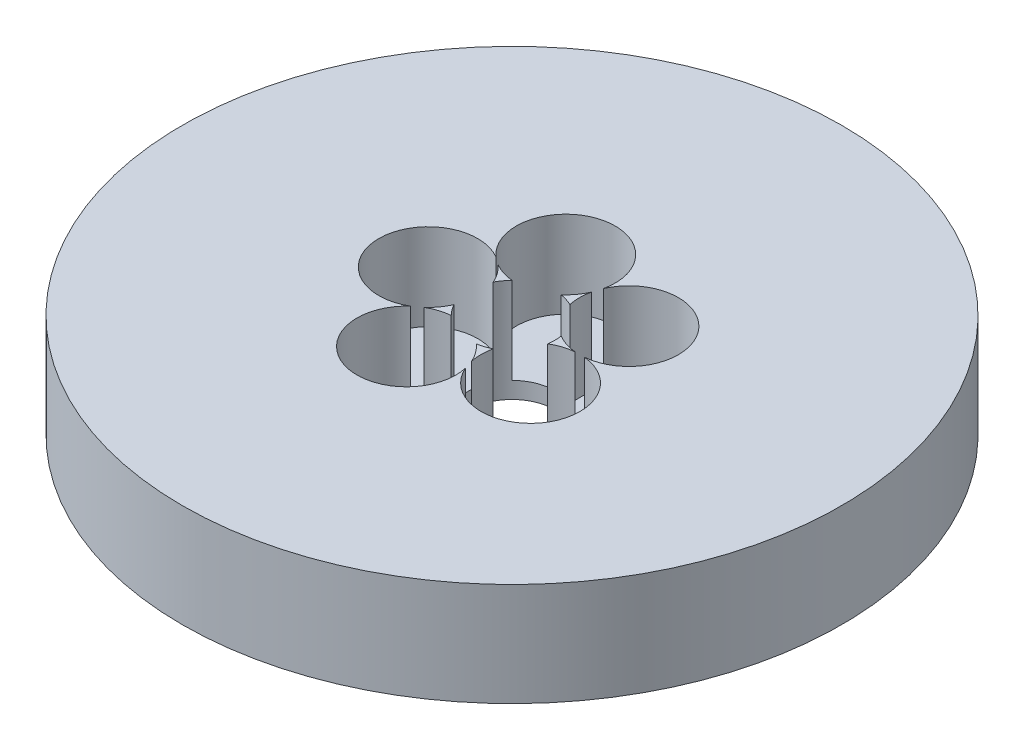
ISO-10303-21;
HEADER;
FILE_DESCRIPTION(('STEP AP214'),'2;1');
FILE_NAME('part.step','',(''),(''),'','','');
FILE_SCHEMA(('AUTOMOTIVE_DESIGN { 1 0 10303 214 1 1 1 1 }'));
ENDSEC;
DATA;
#1=APPLICATION_CONTEXT('core data for automotive mechanical design processes');
#2=APPLICATION_PROTOCOL_DEFINITION('international standard','automotive_design',2000,#1);
#3=PRODUCT_CONTEXT('',#1,'mechanical');
#4=PRODUCT('Part','Part','',(#3));
#5=PRODUCT_RELATED_PRODUCT_CATEGORY('part','',(#4));
#6=PRODUCT_DEFINITION_FORMATION('','',#4);
#7=PRODUCT_DEFINITION_CONTEXT('part definition',#1,'design');
#8=PRODUCT_DEFINITION('design','',#6,#7);
#9=PRODUCT_DEFINITION_SHAPE('','',#8);
#10=(LENGTH_UNIT() NAMED_UNIT(*) SI_UNIT(.MILLI.,.METRE.));
#11=(NAMED_UNIT(*) PLANE_ANGLE_UNIT() SI_UNIT($,.RADIAN.));
#12=(NAMED_UNIT(*) SI_UNIT($,.STERADIAN.) SOLID_ANGLE_UNIT());
#13=UNCERTAINTY_MEASURE_WITH_UNIT(LENGTH_MEASURE(1.E-05),#10,'distance_accuracy_value','');
#14=(GEOMETRIC_REPRESENTATION_CONTEXT(3) GLOBAL_UNCERTAINTY_ASSIGNED_CONTEXT((#13)) GLOBAL_UNIT_ASSIGNED_CONTEXT((#10,
#11,#12)) REPRESENTATION_CONTEXT('',''));
#15=CARTESIAN_POINT('',(0.,0.,0.));
#16=DIRECTION('',(0.,0.,1.));
#17=DIRECTION('',(1.,0.,0.));
#18=AXIS2_PLACEMENT_3D('',#15,#16,#17);
#19=CARTESIAN_POINT('',(0.,18.,0.));
#20=DIRECTION('',(0.,1.,0.));
#21=DIRECTION('',(0.,0.,1.));
#22=AXIS2_PLACEMENT_3D('',#19,#20,#21);
#23=PLANE('',#22);
#24=CARTESIAN_POINT('',(-4.51567267748295,18.,13.8978114587615));
#25=DIRECTION('',(0.,1.,0.));
#26=DIRECTION('',(0.951056516295155,0.,0.309016994374945));
#27=AXIS2_PLACEMENT_3D('',#24,#25,#26);
#28=CIRCLE('',#27,8.62937423145698);
#29=CARTESIAN_POINT('',(-5.30224156649213,18.,5.30435993976305));
#30=VERTEX_POINT('',#29);
#31=CARTESIAN_POINT('',(-8.89248206399116,18.,6.46076639901449));
#32=VERTEX_POINT('',#31);
#33=EDGE_CURVE('E261',#30,#32,#28,.T.);
#34=ORIENTED_EDGE('',*,*,#33,.F.);
#35=CARTESIAN_POINT('',(0.,18.,0.));
#36=DIRECTION('',(0.,1.,0.));
#37=DIRECTION('',(0.,0.,1.));
#38=AXIS2_PLACEMENT_3D('',#35,#36,#37);
#39=CIRCLE('',#38,7.5);
#40=CARTESIAN_POINT('',(-6.68322883781392,18.,3.40359402711493));
#41=VERTEX_POINT('',#40);
#42=EDGE_CURVE('E295',#41,#30,#39,.T.);
#43=ORIENTED_EDGE('',*,*,#42,.F.);
#44=CARTESIAN_POINT('',(-14.6130237484734,18.,0.));
#45=DIRECTION('',(0.,1.,0.));
#46=DIRECTION('',(0.,0.,1.));
#47=AXIS2_PLACEMENT_3D('',#44,#45,#46);
#48=CIRCLE('',#47,8.62937423145698);
#49=EDGE_CURVE('E292',#32,#41,#48,.T.);
#50=ORIENTED_EDGE('',*,*,#49,.F.);
#51=EDGE_LOOP('',(#34,#43,#50));
#52=FACE_BOUND('',#51,.T.);
#53=ADVANCED_FACE('F39',(#52),#23,.T.);
#54=CARTESIAN_POINT('',(-4.51567267748314,18.,-13.8978114587614));
#55=DIRECTION('',(0.,1.,0.));
#56=DIRECTION('',(-0.95105651629515,0.,0.309016994374958));
#57=AXIS2_PLACEMENT_3D('',#54,#55,#56);
#58=CIRCLE('',#57,8.62937423145698);
#59=CARTESIAN_POINT('',(-8.89248206399055,18.,-6.46076639901395));
#60=VERTEX_POINT('',#59);
#61=CARTESIAN_POINT('',(-5.30224156649221,18.,-5.30435993976298));
#62=VERTEX_POINT('',#61);
#63=EDGE_CURVE('E214',#60,#62,#58,.T.);
#64=ORIENTED_EDGE('',*,*,#63,.F.);
#65=CARTESIAN_POINT('',(-6.68322883781392,18.,-3.40359402711493));
#66=VERTEX_POINT('',#65);
#67=EDGE_CURVE('E290',#66,#60,#48,.T.);
#68=ORIENTED_EDGE('',*,*,#67,.F.);
#69=EDGE_CURVE('E300',#62,#66,#39,.T.);
#70=ORIENTED_EDGE('',*,*,#69,.F.);
#71=EDGE_LOOP('',(#64,#68,#70));
#72=FACE_BOUND('',#71,.T.);
#73=ADVANCED_FACE('F387',(#72),#23,.T.);
#74=CARTESIAN_POINT('',(11.8221845517196,18.,-8.58931985075246));
#75=DIRECTION('',(0.,1.,0.));
#76=DIRECTION('',(-0.58778525229248,0.,-0.809016994374942));
#77=AXIS2_PLACEMENT_3D('',#74,#75,#76);
#78=CIRCLE('',#77,8.62937423145698);
#79=CARTESIAN_POINT('',(7.40742808101708,18.,-1.17473793867381));
#80=VERTEX_POINT('',#79);
#81=CARTESIAN_POINT('',(10.9917123197907,18.,0.));
#82=VERTEX_POINT('',#81);
#83=EDGE_CURVE('E202',#80,#82,#78,.T.);
#84=ORIENTED_EDGE('',*,*,#83,.F.);
#85=CARTESIAN_POINT('',(7.4074280810171,18.,1.17473793867371));
#86=VERTEX_POINT('',#85);
#87=EDGE_CURVE('E350',#86,#80,#39,.T.);
#88=ORIENTED_EDGE('',*,*,#87,.F.);
#89=CARTESIAN_POINT('',(11.8221845517197,18.,8.58931985075229));
#90=DIRECTION('',(0.,1.,0.));
#91=DIRECTION('',(0.587785252292469,0.,-0.809016994374951));
#92=AXIS2_PLACEMENT_3D('',#89,#90,#91);
#93=CIRCLE('',#92,8.62937423145698);
#94=EDGE_CURVE('E243',#82,#86,#93,.T.);
#95=ORIENTED_EDGE('',*,*,#94,.F.);
#96=EDGE_LOOP('',(#84,#88,#95));
#97=FACE_BOUND('',#96,.T.);
#98=ADVANCED_FACE('F392',(#97),#23,.T.);
#99=CARTESIAN_POINT('',(3.40626333315933,18.,6.68186875845181));
#100=VERTEX_POINT('',#99);
#101=CARTESIAN_POINT('',(3.39662590409586,18.,10.4537396269787));
#102=VERTEX_POINT('',#101);
#103=EDGE_CURVE('E244',#100,#102,#93,.T.);
#104=ORIENTED_EDGE('',*,*,#103,.F.);
#105=CARTESIAN_POINT('',(1.1717789901297,18.,7.40789673242619));
#106=VERTEX_POINT('',#105);
#107=EDGE_CURVE('E296',#106,#100,#39,.T.);
#108=ORIENTED_EDGE('',*,*,#107,.F.);
#109=EDGE_CURVE('E259',#102,#106,#28,.T.);
#110=ORIENTED_EDGE('',*,*,#109,.F.);
#111=EDGE_LOOP('',(#104,#108,#110));
#112=FACE_BOUND('',#111,.T.);
#113=ADVANCED_FACE('F352',(#112),#23,.T.);
#114=CARTESIAN_POINT('',(3.3966259040957,18.,-10.4537396269787));
#115=VERTEX_POINT('',#114);
#116=CARTESIAN_POINT('',(3.40626333315923,18.,-6.68186875845186));
#117=VERTEX_POINT('',#116);
#118=EDGE_CURVE('E208',#115,#117,#78,.T.);
#119=ORIENTED_EDGE('',*,*,#118,.F.);
#120=CARTESIAN_POINT('',(1.1717789901296,18.,-7.40789673242621));
#121=VERTEX_POINT('',#120);
#122=EDGE_CURVE('E216',#121,#115,#58,.T.);
#123=ORIENTED_EDGE('',*,*,#122,.F.);
#124=EDGE_CURVE('E233',#117,#121,#39,.T.);
#125=ORIENTED_EDGE('',*,*,#124,.F.);
#126=EDGE_LOOP('',(#119,#123,#125));
#127=FACE_BOUND('',#126,.T.);
#128=ADVANCED_FACE('F232',(#127),#23,.T.);
#129=CARTESIAN_POINT('',(-14.6130237484734,2.88398085413681,0.));
#130=DIRECTION('',(0.,1.,0.));
#131=DIRECTION('',(0.,0.,1.));
#132=AXIS2_PLACEMENT_3D('',#129,#130,#131);
#133=CYLINDRICAL_SURFACE('',#132,8.62937423145698);
#134=CARTESIAN_POINT('',(-14.6130237484734,2.88398085413681,0.));
#135=DIRECTION('',(0.,1.,0.));
#136=DIRECTION('',(0.,0.,1.));
#137=AXIS2_PLACEMENT_3D('',#134,#135,#136);
#138=CIRCLE('',#137,8.62937423145698);
#139=CARTESIAN_POINT('',(-8.89248206399116,2.88398085413681,6.46076639901449));
#140=VERTEX_POINT('',#139);
#141=CARTESIAN_POINT('',(-6.68322883781392,2.88398085413681,3.40359402711493));
#142=VERTEX_POINT('',#141);
#143=EDGE_CURVE('E65',#140,#142,#138,.T.);
#144=ORIENTED_EDGE('',*,*,#143,.F.);
#145=DIRECTION('',(0.,1.,0.));
#146=VECTOR('',#145,1.);
#147=CARTESIAN_POINT('',(-8.89248206399116,10.4419904270684,6.46076639901449));
#148=LINE('',#147,#146);
#149=EDGE_CURVE('E269',#140,#32,#148,.T.);
#150=ORIENTED_EDGE('',*,*,#149,.T.);
#151=ORIENTED_EDGE('',*,*,#49,.T.);
#152=DIRECTION('',(0.,1.,0.));
#153=VECTOR('',#152,1.);
#154=CARTESIAN_POINT('',(-6.68322883781392,10.4419904270684,3.40359402711493));
#155=LINE('',#154,#153);
#156=EDGE_CURVE('E306',#41,#142,#155,.F.);
#157=ORIENTED_EDGE('',*,*,#156,.T.);
#158=EDGE_LOOP('',(#144,#150,#151,#157));
#159=FACE_BOUND('',#158,.T.);
#160=ADVANCED_FACE('F406',(#159),#133,.F.);
#161=CARTESIAN_POINT('',(-10.236214361966,18.,-7.43704505974748));
#162=VERTEX_POINT('',#161);
#163=CARTESIAN_POINT('',(-10.2362143619652,18.,7.43704505974701));
#164=VERTEX_POINT('',#163);
#165=EDGE_CURVE('E289',#162,#164,#48,.T.);
#166=ORIENTED_EDGE('',*,*,#165,.T.);
#167=DIRECTION('',(0.,1.,0.));
#168=VECTOR('',#167,1.);
#169=CARTESIAN_POINT('',(-10.2362143619652,10.4419904270684,7.43704505974701));
#170=LINE('',#169,#168);
#171=CARTESIAN_POINT('',(-10.2362143619652,2.88398085413681,7.43704505974701));
#172=VERTEX_POINT('',#171);
#173=EDGE_CURVE('E270',#164,#172,#170,.F.);
#174=ORIENTED_EDGE('',*,*,#173,.T.);
#175=CARTESIAN_POINT('',(-10.236214361966,2.88398085413681,-7.43704505974748));
#176=VERTEX_POINT('',#175);
#177=EDGE_CURVE('E286',#176,#172,#138,.T.);
#178=ORIENTED_EDGE('',*,*,#177,.F.);
#179=DIRECTION('',(0.,1.,0.));
#180=VECTOR('',#179,1.);
#181=CARTESIAN_POINT('',(-10.236214361966,10.4419904270684,-7.43704505974748));
#182=LINE('',#181,#180);
#183=EDGE_CURVE('E204',#176,#162,#182,.T.);
#184=ORIENTED_EDGE('',*,*,#183,.T.);
#185=EDGE_LOOP('',(#166,#174,#178,#184));
#186=FACE_BOUND('',#185,.T.);
#187=ADVANCED_FACE('F370',(#186),#133,.F.);
#188=CARTESIAN_POINT('',(0.,18.,0.));
#189=DIRECTION('',(0.,-1.,0.));
#190=DIRECTION('',(0.,0.,-1.));
#191=AXIS2_PLACEMENT_3D('',#188,#189,#190);
#192=CYLINDRICAL_SURFACE('',#191,57.5);
#193=CARTESIAN_POINT('',(0.,18.,0.));
#194=DIRECTION('',(0.,1.,0.));
#195=DIRECTION('',(0.,0.,1.));
#196=AXIS2_PLACEMENT_3D('',#193,#194,#195);
#197=CIRCLE('',#196,57.5);
#198=CARTESIAN_POINT('',(0.,18.,57.5));
#199=VERTEX_POINT('',#198);
#200=EDGE_CURVE('E299',#199,#199,#197,.T.);
#201=ORIENTED_EDGE('',*,*,#200,.F.);
#202=EDGE_LOOP('',(#201));
#203=FACE_BOUND('',#202,.T.);
#204=CARTESIAN_POINT('',(0.,0.,0.));
#205=DIRECTION('',(0.,1.,0.));
#206=DIRECTION('',(0.,0.,1.));
#207=AXIS2_PLACEMENT_3D('',#204,#205,#206);
#208=CIRCLE('',#207,57.5);
#209=CARTESIAN_POINT('',(0.,0.,57.5));
#210=VERTEX_POINT('',#209);
#211=EDGE_CURVE('E293',#210,#210,#208,.T.);
#212=ORIENTED_EDGE('',*,*,#211,.T.);
#213=EDGE_LOOP('',(#212));
#214=FACE_BOUND('',#213,.T.);
#215=ADVANCED_FACE('F41',(#203,#214),#192,.T.);
#216=CARTESIAN_POINT('',(3.90988597014094,18.,12.0333916825351));
#217=VERTEX_POINT('',#216);
#218=EDGE_CURVE('E252',#164,#217,#28,.T.);
#219=ORIENTED_EDGE('',*,*,#218,.F.);
#220=ORIENTED_EDGE('',*,*,#165,.F.);
#221=CARTESIAN_POINT('',(3.90988597014077,18.,-12.0333916825352));
#222=VERTEX_POINT('',#221);
#223=EDGE_CURVE('E211',#222,#162,#58,.T.);
#224=ORIENTED_EDGE('',*,*,#223,.F.);
#225=CARTESIAN_POINT('',(12.6526567836486,18.,0.));
#226=VERTEX_POINT('',#225);
#227=EDGE_CURVE('E198',#226,#222,#78,.T.);
#228=ORIENTED_EDGE('',*,*,#227,.F.);
#229=EDGE_CURVE('E238',#217,#226,#93,.T.);
#230=ORIENTED_EDGE('',*,*,#229,.F.);
#231=EDGE_LOOP('',(#219,#220,#224,#228,#230));
#232=FACE_BOUND('',#231,.T.);
#233=ORIENTED_EDGE('',*,*,#200,.T.);
#234=EDGE_LOOP('',(#233));
#235=FACE_BOUND('',#234,.T.);
#236=ADVANCED_FACE('F362',(#232,#235),#23,.T.);
#237=CARTESIAN_POINT('',(0.,0.,0.));
#238=DIRECTION('',(0.,1.,0.));
#239=DIRECTION('',(0.,0.,1.));
#240=AXIS2_PLACEMENT_3D('',#237,#238,#239);
#241=PLANE('',#240);
#242=CARTESIAN_POINT('',(0.,0.,0.));
#243=DIRECTION('',(0.,1.,0.));
#244=DIRECTION('',(0.,0.,1.));
#245=AXIS2_PLACEMENT_3D('',#242,#243,#244);
#246=CIRCLE('',#245,7.5);
#247=CARTESIAN_POINT('',(0.,0.,7.5));
#248=VERTEX_POINT('',#247);
#249=EDGE_CURVE('E284',#248,#248,#246,.T.);
#250=ORIENTED_EDGE('',*,*,#249,.T.);
#251=EDGE_LOOP('',(#250));
#252=FACE_BOUND('',#251,.T.);
#253=ORIENTED_EDGE('',*,*,#211,.F.);
#254=EDGE_LOOP('',(#253));
#255=FACE_BOUND('',#254,.T.);
#256=ADVANCED_FACE('F400',(#252,#255),#241,.F.);
#257=CARTESIAN_POINT('',(0.,18.,0.));
#258=DIRECTION('',(0.,-1.,0.));
#259=DIRECTION('',(0.,0.,-1.));
#260=AXIS2_PLACEMENT_3D('',#257,#258,#259);
#261=CYLINDRICAL_SURFACE('',#260,7.5);
#262=DIRECTION('',(0.,1.,0.));
#263=VECTOR('',#262,1.);
#264=CARTESIAN_POINT('',(-5.30224156649213,10.4419904270684,5.30435993976305));
#265=LINE('',#264,#263);
#266=CARTESIAN_POINT('',(-5.30224156649213,2.88398085413681,5.30435993976305));
#267=VERTEX_POINT('',#266);
#268=EDGE_CURVE('E274',#267,#30,#265,.T.);
#269=ORIENTED_EDGE('',*,*,#268,.F.);
#270=CARTESIAN_POINT('',(0.,2.88398085413681,0.));
#271=DIRECTION('',(0.,1.,0.));
#272=DIRECTION('',(0.,0.,1.));
#273=AXIS2_PLACEMENT_3D('',#270,#271,#272);
#274=CIRCLE('',#273,7.5);
#275=CARTESIAN_POINT('',(1.1717789901297,2.88398085413681,7.40789673242619));
#276=VERTEX_POINT('',#275);
#277=EDGE_CURVE('E280',#267,#276,#274,.T.);
#278=ORIENTED_EDGE('',*,*,#277,.T.);
#279=DIRECTION('',(0.,1.,0.));
#280=VECTOR('',#279,1.);
#281=CARTESIAN_POINT('',(1.1717789901297,10.4419904270684,7.40789673242619));
#282=LINE('',#281,#280);
#283=EDGE_CURVE('E272',#106,#276,#282,.F.);
#284=ORIENTED_EDGE('',*,*,#283,.F.);
#285=ORIENTED_EDGE('',*,*,#107,.T.);
#286=DIRECTION('',(0.,1.,0.));
#287=VECTOR('',#286,1.);
#288=CARTESIAN_POINT('',(3.40626333315933,10.4419904270684,6.68186875845181));
#289=LINE('',#288,#287);
#290=CARTESIAN_POINT('',(3.40626333315933,2.88398085413681,6.68186875845181));
#291=VERTEX_POINT('',#290);
#292=EDGE_CURVE('E11',#291,#100,#289,.T.);
#293=ORIENTED_EDGE('',*,*,#292,.F.);
#294=CARTESIAN_POINT('',(7.4074280810171,2.88398085413681,1.17473793867371));
#295=VERTEX_POINT('',#294);
#296=EDGE_CURVE('E281',#291,#295,#274,.T.);
#297=ORIENTED_EDGE('',*,*,#296,.T.);
#298=DIRECTION('',(0.,1.,0.));
#299=VECTOR('',#298,1.);
#300=CARTESIAN_POINT('',(7.4074280810171,10.4419904270684,1.17473793867371));
#301=LINE('',#300,#299);
#302=EDGE_CURVE('E50',#86,#295,#301,.F.);
#303=ORIENTED_EDGE('',*,*,#302,.F.);
#304=ORIENTED_EDGE('',*,*,#87,.T.);
#305=DIRECTION('',(0.,1.,0.));
#306=VECTOR('',#305,1.);
#307=CARTESIAN_POINT('',(7.40742808101708,10.4419904270684,-1.17473793867381));
#308=LINE('',#307,#306);
#309=CARTESIAN_POINT('',(7.40742808101708,2.88398085413681,-1.17473793867381));
#310=VERTEX_POINT('',#309);
#311=EDGE_CURVE('E312',#310,#80,#308,.T.);
#312=ORIENTED_EDGE('',*,*,#311,.F.);
#313=CARTESIAN_POINT('',(3.40626333315923,2.88398085413681,-6.68186875845186));
#314=VERTEX_POINT('',#313);
#315=EDGE_CURVE('E334',#310,#314,#274,.T.);
#316=ORIENTED_EDGE('',*,*,#315,.T.);
#317=DIRECTION('',(0.,1.,0.));
#318=VECTOR('',#317,1.);
#319=CARTESIAN_POINT('',(3.40626333315923,10.4419904270684,-6.68186875845186));
#320=LINE('',#319,#318);
#321=EDGE_CURVE('E311',#117,#314,#320,.F.);
#322=ORIENTED_EDGE('',*,*,#321,.F.);
#323=ORIENTED_EDGE('',*,*,#124,.T.);
#324=DIRECTION('',(0.,1.,0.));
#325=VECTOR('',#324,1.);
#326=CARTESIAN_POINT('',(1.1717789901296,10.4419904270684,-7.40789673242621));
#327=LINE('',#326,#325);
#328=CARTESIAN_POINT('',(1.1717789901296,2.88398085413681,-7.40789673242621));
#329=VERTEX_POINT('',#328);
#330=EDGE_CURVE('E224',#329,#121,#327,.T.);
#331=ORIENTED_EDGE('',*,*,#330,.F.);
#332=CARTESIAN_POINT('',(-5.30224156649221,2.88398085413681,-5.30435993976298));
#333=VERTEX_POINT('',#332);
#334=EDGE_CURVE('E278',#329,#333,#274,.T.);
#335=ORIENTED_EDGE('',*,*,#334,.T.);
#336=DIRECTION('',(0.,1.,0.));
#337=VECTOR('',#336,1.);
#338=CARTESIAN_POINT('',(-5.3022415664922,10.4419904270684,-5.30435993976298));
#339=LINE('',#338,#337);
#340=EDGE_CURVE('E262',#62,#333,#339,.F.);
#341=ORIENTED_EDGE('',*,*,#340,.F.);
#342=ORIENTED_EDGE('',*,*,#69,.T.);
#343=DIRECTION('',(0.,1.,0.));
#344=VECTOR('',#343,1.);
#345=CARTESIAN_POINT('',(-6.68322883781392,10.4419904270684,-3.40359402711493));
#346=LINE('',#345,#344);
#347=CARTESIAN_POINT('',(-6.68322883781392,2.88398085413681,-3.40359402711493));
#348=VERTEX_POINT('',#347);
#349=EDGE_CURVE('E309',#348,#66,#346,.T.);
#350=ORIENTED_EDGE('',*,*,#349,.F.);
#351=CARTESIAN_POINT('',(0.,2.88398085413681,0.));
#352=DIRECTION('',(0.,1.,0.));
#353=DIRECTION('',(0.,0.,1.));
#354=AXIS2_PLACEMENT_3D('',#351,#352,#353);
#355=CIRCLE('',#354,7.5);
#356=EDGE_CURVE('E302',#348,#142,#355,.T.);
#357=ORIENTED_EDGE('',*,*,#356,.T.);
#358=ORIENTED_EDGE('',*,*,#156,.F.);
#359=ORIENTED_EDGE('',*,*,#42,.T.);
#360=EDGE_LOOP('',(#269,#278,#284,#285,#293,#297,#303,#304,#312,#316,#322,#323,#331,#335,#341,
#342,#350,#357,#358,#359));
#361=FACE_BOUND('',#360,.T.);
#362=ORIENTED_EDGE('',*,*,#249,.F.);
#363=EDGE_LOOP('',(#362));
#364=FACE_BOUND('',#363,.T.);
#365=ADVANCED_FACE('F329',(#361,#364),#261,.F.);
#366=ORIENTED_EDGE('',*,*,#67,.T.);
#367=DIRECTION('',(0.,1.,0.));
#368=VECTOR('',#367,1.);
#369=CARTESIAN_POINT('',(-8.89248206399055,10.4419904270684,-6.46076639901395));
#370=LINE('',#369,#368);
#371=CARTESIAN_POINT('',(-8.89248206399055,2.88398085413681,-6.46076639901395));
#372=VERTEX_POINT('',#371);
#373=EDGE_CURVE('E258',#60,#372,#370,.F.);
#374=ORIENTED_EDGE('',*,*,#373,.T.);
#375=EDGE_CURVE('E285',#348,#372,#138,.T.);
#376=ORIENTED_EDGE('',*,*,#375,.F.);
#377=ORIENTED_EDGE('',*,*,#349,.T.);
#378=EDGE_LOOP('',(#366,#374,#376,#377));
#379=FACE_BOUND('',#378,.T.);
#380=ADVANCED_FACE('F345',(#379),#133,.F.);
#381=CARTESIAN_POINT('',(-14.6130237484734,2.88398085413681,0.));
#382=DIRECTION('',(0.,1.,0.));
#383=DIRECTION('',(0.,0.,1.));
#384=AXIS2_PLACEMENT_3D('',#381,#382,#383);
#385=PLANE('',#384);
#386=CARTESIAN_POINT('',(-4.51567267748314,2.88398085413681,-13.8978114587614));
#387=DIRECTION('',(0.,1.,0.));
#388=DIRECTION('',(-0.95105651629515,0.,0.309016994374958));
#389=AXIS2_PLACEMENT_3D('',#386,#387,#388);
#390=CIRCLE('',#389,8.62937423145698);
#391=CARTESIAN_POINT('',(3.90988597014078,2.88398085413681,-12.0333916825352));
#392=VERTEX_POINT('',#391);
#393=EDGE_CURVE('E182',#392,#176,#390,.T.);
#394=ORIENTED_EDGE('',*,*,#393,.T.);
#395=ORIENTED_EDGE('',*,*,#177,.T.);
#396=CARTESIAN_POINT('',(-4.51567267748295,2.88398085413681,13.8978114587615));
#397=DIRECTION('',(0.,1.,0.));
#398=DIRECTION('',(0.951056516295155,0.,0.309016994374945));
#399=AXIS2_PLACEMENT_3D('',#396,#397,#398);
#400=CIRCLE('',#399,8.62937423145698);
#401=CARTESIAN_POINT('',(3.90988597014094,2.88398085413681,12.0333916825351));
#402=VERTEX_POINT('',#401);
#403=EDGE_CURVE('E256',#172,#402,#400,.T.);
#404=ORIENTED_EDGE('',*,*,#403,.T.);
#405=CARTESIAN_POINT('',(11.8221845517197,2.88398085413681,8.58931985075229));
#406=DIRECTION('',(0.,1.,0.));
#407=DIRECTION('',(0.587785252292469,0.,-0.809016994374951));
#408=AXIS2_PLACEMENT_3D('',#405,#406,#407);
#409=CIRCLE('',#408,8.62937423145698);
#410=CARTESIAN_POINT('',(12.6526567836486,2.88398085413681,0.));
#411=VERTEX_POINT('',#410);
#412=EDGE_CURVE('E184',#402,#411,#409,.T.);
#413=ORIENTED_EDGE('',*,*,#412,.T.);
#414=CARTESIAN_POINT('',(11.8221845517196,2.88398085413681,-8.58931985075246));
#415=DIRECTION('',(0.,1.,0.));
#416=DIRECTION('',(-0.58778525229248,0.,-0.809016994374942));
#417=AXIS2_PLACEMENT_3D('',#414,#415,#416);
#418=CIRCLE('',#417,8.62937423145698);
#419=EDGE_CURVE('E176',#411,#392,#418,.T.);
#420=ORIENTED_EDGE('',*,*,#419,.T.);
#421=EDGE_LOOP('',(#394,#395,#404,#413,#420));
#422=FACE_BOUND('',#421,.T.);
#423=ORIENTED_EDGE('',*,*,#375,.T.);
#424=EDGE_CURVE('E53',#372,#333,#390,.T.);
#425=ORIENTED_EDGE('',*,*,#424,.T.);
#426=ORIENTED_EDGE('',*,*,#334,.F.);
#427=CARTESIAN_POINT('',(3.3966259040957,2.88398085413681,-10.4537396269787));
#428=VERTEX_POINT('',#427);
#429=EDGE_CURVE('E210',#329,#428,#390,.T.);
#430=ORIENTED_EDGE('',*,*,#429,.T.);
#431=EDGE_CURVE('E188',#428,#314,#418,.T.);
#432=ORIENTED_EDGE('',*,*,#431,.T.);
#433=ORIENTED_EDGE('',*,*,#315,.F.);
#434=CARTESIAN_POINT('',(10.9917123197907,2.88398085413681,0.));
#435=VERTEX_POINT('',#434);
#436=EDGE_CURVE('E191',#310,#435,#418,.T.);
#437=ORIENTED_EDGE('',*,*,#436,.T.);
#438=EDGE_CURVE('E199',#435,#295,#409,.T.);
#439=ORIENTED_EDGE('',*,*,#438,.T.);
#440=ORIENTED_EDGE('',*,*,#296,.F.);
#441=CARTESIAN_POINT('',(3.39662590409586,2.88398085413681,10.4537396269787));
#442=VERTEX_POINT('',#441);
#443=EDGE_CURVE('E242',#291,#442,#409,.T.);
#444=ORIENTED_EDGE('',*,*,#443,.T.);
#445=EDGE_CURVE('E251',#442,#276,#400,.T.);
#446=ORIENTED_EDGE('',*,*,#445,.T.);
#447=ORIENTED_EDGE('',*,*,#277,.F.);
#448=EDGE_CURVE('E260',#267,#140,#400,.T.);
#449=ORIENTED_EDGE('',*,*,#448,.T.);
#450=ORIENTED_EDGE('',*,*,#143,.T.);
#451=ORIENTED_EDGE('',*,*,#356,.F.);
#452=EDGE_LOOP('',(#423,#425,#426,#430,#432,#433,#437,#439,#440,#444,#446,#447,#449,#450,#451));
#453=FACE_BOUND('',#452,.T.);
#454=ADVANCED_FACE('F177',(#422,#453),#385,.T.);
#455=CARTESIAN_POINT('',(11.8221845517197,2.88398085413681,8.58931985075229));
#456=DIRECTION('',(0.,1.,0.));
#457=DIRECTION('',(0.,0.,1.));
#458=AXIS2_PLACEMENT_3D('',#455,#456,#457);
#459=CYLINDRICAL_SURFACE('',#458,8.62937423145698);
#460=ORIENTED_EDGE('',*,*,#292,.T.);
#461=ORIENTED_EDGE('',*,*,#103,.T.);
#462=DIRECTION('',(0.,1.,0.));
#463=VECTOR('',#462,1.);
#464=CARTESIAN_POINT('',(3.39662590409586,10.4419904270684,10.4537396269787));
#465=LINE('',#464,#463);
#466=EDGE_CURVE('E248',#442,#102,#465,.T.);
#467=ORIENTED_EDGE('',*,*,#466,.F.);
#468=ORIENTED_EDGE('',*,*,#443,.F.);
#469=EDGE_LOOP('',(#460,#461,#467,#468));
#470=FACE_BOUND('',#469,.T.);
#471=ADVANCED_FACE('F371',(#470),#459,.F.);
#472=CARTESIAN_POINT('',(11.8221845517196,2.88398085413681,-8.58931985075246));
#473=DIRECTION('',(0.,1.,0.));
#474=DIRECTION('',(0.,0.,1.));
#475=AXIS2_PLACEMENT_3D('',#472,#473,#474);
#476=CYLINDRICAL_SURFACE('',#475,8.62937423145698);
#477=ORIENTED_EDGE('',*,*,#311,.T.);
#478=ORIENTED_EDGE('',*,*,#83,.T.);
#479=DIRECTION('',(0.,1.,0.));
#480=VECTOR('',#479,1.);
#481=CARTESIAN_POINT('',(10.9917123197907,10.4419904270684,0.));
#482=LINE('',#481,#480);
#483=EDGE_CURVE('E240',#435,#82,#482,.T.);
#484=ORIENTED_EDGE('',*,*,#483,.F.);
#485=ORIENTED_EDGE('',*,*,#436,.F.);
#486=EDGE_LOOP('',(#477,#478,#484,#485));
#487=FACE_BOUND('',#486,.T.);
#488=ADVANCED_FACE('F381',(#487),#476,.F.);
#489=CARTESIAN_POINT('',(-4.51567267748295,2.88398085413681,13.8978114587615));
#490=DIRECTION('',(0.,1.,0.));
#491=DIRECTION('',(0.,0.,1.));
#492=AXIS2_PLACEMENT_3D('',#489,#490,#491);
#493=CYLINDRICAL_SURFACE('',#492,8.62937423145698);
#494=ORIENTED_EDGE('',*,*,#268,.T.);
#495=ORIENTED_EDGE('',*,*,#33,.T.);
#496=ORIENTED_EDGE('',*,*,#149,.F.);
#497=ORIENTED_EDGE('',*,*,#448,.F.);
#498=EDGE_LOOP('',(#494,#495,#496,#497));
#499=FACE_BOUND('',#498,.T.);
#500=ADVANCED_FACE('F374',(#499),#493,.F.);
#501=ORIENTED_EDGE('',*,*,#283,.T.);
#502=ORIENTED_EDGE('',*,*,#445,.F.);
#503=ORIENTED_EDGE('',*,*,#466,.T.);
#504=ORIENTED_EDGE('',*,*,#109,.T.);
#505=EDGE_LOOP('',(#501,#502,#503,#504));
#506=FACE_BOUND('',#505,.T.);
#507=ADVANCED_FACE('F373',(#506),#493,.F.);
#508=ORIENTED_EDGE('',*,*,#218,.T.);
#509=DIRECTION('',(0.,1.,0.));
#510=VECTOR('',#509,1.);
#511=CARTESIAN_POINT('',(3.90988597014094,10.4419904270684,12.0333916825351));
#512=LINE('',#511,#510);
#513=EDGE_CURVE('E231',#217,#402,#512,.F.);
#514=ORIENTED_EDGE('',*,*,#513,.T.);
#515=ORIENTED_EDGE('',*,*,#403,.F.);
#516=ORIENTED_EDGE('',*,*,#173,.F.);
#517=EDGE_LOOP('',(#508,#514,#515,#516));
#518=FACE_BOUND('',#517,.T.);
#519=ADVANCED_FACE('F369',(#518),#493,.F.);
#520=CARTESIAN_POINT('',(-4.51567267748314,2.88398085413681,-13.8978114587614));
#521=DIRECTION('',(0.,1.,0.));
#522=DIRECTION('',(0.,0.,1.));
#523=AXIS2_PLACEMENT_3D('',#520,#521,#522);
#524=CYLINDRICAL_SURFACE('',#523,8.62937423145698);
#525=ORIENTED_EDGE('',*,*,#330,.T.);
#526=ORIENTED_EDGE('',*,*,#122,.T.);
#527=DIRECTION('',(0.,1.,0.));
#528=VECTOR('',#527,1.);
#529=CARTESIAN_POINT('',(3.39662590409571,10.4419904270684,-10.4537396269787));
#530=LINE('',#529,#528);
#531=EDGE_CURVE('E200',#428,#115,#530,.T.);
#532=ORIENTED_EDGE('',*,*,#531,.F.);
#533=ORIENTED_EDGE('',*,*,#429,.F.);
#534=EDGE_LOOP('',(#525,#526,#532,#533));
#535=FACE_BOUND('',#534,.T.);
#536=ADVANCED_FACE('F219',(#535),#524,.F.);
#537=ORIENTED_EDGE('',*,*,#393,.F.);
#538=DIRECTION('',(0.,1.,0.));
#539=VECTOR('',#538,1.);
#540=CARTESIAN_POINT('',(3.90988597014078,10.4419904270684,-12.0333916825352));
#541=LINE('',#540,#539);
#542=EDGE_CURVE('E192',#222,#392,#541,.F.);
#543=ORIENTED_EDGE('',*,*,#542,.F.);
#544=ORIENTED_EDGE('',*,*,#223,.T.);
#545=ORIENTED_EDGE('',*,*,#183,.F.);
#546=EDGE_LOOP('',(#537,#543,#544,#545));
#547=FACE_BOUND('',#546,.T.);
#548=ADVANCED_FACE('F205',(#547),#524,.F.);
#549=ORIENTED_EDGE('',*,*,#340,.T.);
#550=ORIENTED_EDGE('',*,*,#424,.F.);
#551=ORIENTED_EDGE('',*,*,#373,.F.);
#552=ORIENTED_EDGE('',*,*,#63,.T.);
#553=EDGE_LOOP('',(#549,#550,#551,#552));
#554=FACE_BOUND('',#553,.T.);
#555=ADVANCED_FACE('F434',(#554),#524,.F.);
#556=ORIENTED_EDGE('',*,*,#302,.T.);
#557=ORIENTED_EDGE('',*,*,#438,.F.);
#558=ORIENTED_EDGE('',*,*,#483,.T.);
#559=ORIENTED_EDGE('',*,*,#94,.T.);
#560=EDGE_LOOP('',(#556,#557,#558,#559));
#561=FACE_BOUND('',#560,.T.);
#562=ADVANCED_FACE('F317',(#561),#459,.F.);
#563=ORIENTED_EDGE('',*,*,#321,.T.);
#564=ORIENTED_EDGE('',*,*,#431,.F.);
#565=ORIENTED_EDGE('',*,*,#531,.T.);
#566=ORIENTED_EDGE('',*,*,#118,.T.);
#567=EDGE_LOOP('',(#563,#564,#565,#566));
#568=FACE_BOUND('',#567,.T.);
#569=ADVANCED_FACE('F228',(#568),#476,.F.);
#570=ORIENTED_EDGE('',*,*,#229,.T.);
#571=DIRECTION('',(0.,1.,0.));
#572=VECTOR('',#571,1.);
#573=CARTESIAN_POINT('',(12.6526567836486,10.4419904270684,0.));
#574=LINE('',#573,#572);
#575=EDGE_CURVE('E187',#226,#411,#574,.F.);
#576=ORIENTED_EDGE('',*,*,#575,.T.);
#577=ORIENTED_EDGE('',*,*,#412,.F.);
#578=ORIENTED_EDGE('',*,*,#513,.F.);
#579=EDGE_LOOP('',(#570,#576,#577,#578));
#580=FACE_BOUND('',#579,.T.);
#581=ADVANCED_FACE('F358',(#580),#459,.F.);
#582=ORIENTED_EDGE('',*,*,#542,.T.);
#583=ORIENTED_EDGE('',*,*,#419,.F.);
#584=ORIENTED_EDGE('',*,*,#575,.F.);
#585=ORIENTED_EDGE('',*,*,#227,.T.);
#586=EDGE_LOOP('',(#582,#583,#584,#585));
#587=FACE_BOUND('',#586,.T.);
#588=ADVANCED_FACE('F193',(#587),#476,.F.);
#589=CLOSED_SHELL('',(#53,#73,#98,#113,#128,#160,#187,#215,#236,#256,#365,#380,#454,#471,#488,
#500,#507,#519,#536,#548,#555,#562,#569,#581,#588));
#590=MANIFOLD_SOLID_BREP('B2',#589);
#591=ADVANCED_BREP_SHAPE_REPRESENTATION('',(#18,#590),#14);
#592=SHAPE_DEFINITION_REPRESENTATION(#9,#591);
ENDSEC;
END-ISO-10303-21;
